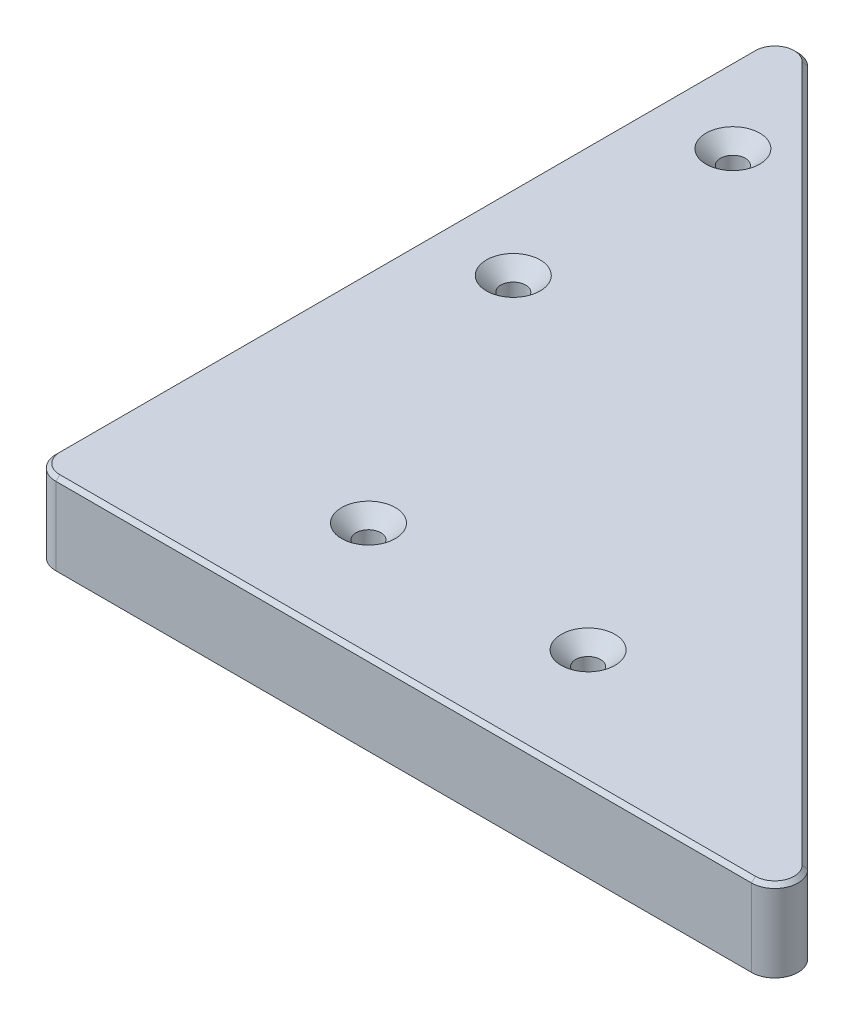
ISO-10303-21;
HEADER;
FILE_DESCRIPTION(('STEP AP214'),'2;1');
FILE_NAME('part.step','',(''),(''),'','','');
FILE_SCHEMA(('AUTOMOTIVE_DESIGN { 1 0 10303 214 1 1 1 1 }'));
ENDSEC;
DATA;
#1=APPLICATION_CONTEXT('core data for automotive mechanical design processes');
#2=APPLICATION_PROTOCOL_DEFINITION('international standard','automotive_design',2000,#1);
#3=PRODUCT_CONTEXT('',#1,'mechanical');
#4=PRODUCT('Part','Part','',(#3));
#5=PRODUCT_RELATED_PRODUCT_CATEGORY('part','',(#4));
#6=PRODUCT_DEFINITION_FORMATION('','',#4);
#7=PRODUCT_DEFINITION_CONTEXT('part definition',#1,'design');
#8=PRODUCT_DEFINITION('design','',#6,#7);
#9=PRODUCT_DEFINITION_SHAPE('','',#8);
#10=(LENGTH_UNIT() NAMED_UNIT(*) SI_UNIT(.MILLI.,.METRE.));
#11=(NAMED_UNIT(*) PLANE_ANGLE_UNIT() SI_UNIT($,.RADIAN.));
#12=(NAMED_UNIT(*) SI_UNIT($,.STERADIAN.) SOLID_ANGLE_UNIT());
#13=UNCERTAINTY_MEASURE_WITH_UNIT(LENGTH_MEASURE(1.E-05),#10,'distance_accuracy_value','');
#14=(GEOMETRIC_REPRESENTATION_CONTEXT(3) GLOBAL_UNCERTAINTY_ASSIGNED_CONTEXT((#13)) GLOBAL_UNIT_ASSIGNED_CONTEXT((#10,
#11,#12)) REPRESENTATION_CONTEXT('',''));
#15=CARTESIAN_POINT('',(0.,0.,0.));
#16=DIRECTION('',(0.,0.,1.));
#17=DIRECTION('',(1.,0.,0.));
#18=AXIS2_PLACEMENT_3D('',#15,#16,#17);
#19=CARTESIAN_POINT('',(0.,0.,0.));
#20=DIRECTION('',(0.,1.,0.));
#21=DIRECTION('',(0.,0.,1.));
#22=AXIS2_PLACEMENT_3D('',#19,#20,#21);
#23=PLANE('',#22);
#24=CARTESIAN_POINT('',(-37.9999999999917,0.,-73.8495209309873));
#25=DIRECTION('',(0.,1.,0.));
#26=DIRECTION('',(0.,0.,1.));
#27=AXIS2_PLACEMENT_3D('',#24,#25,#26);
#28=CIRCLE('',#27,1.59999999999999);
#29=CARTESIAN_POINT('',(-37.9999999999917,0.,-72.2495209309873));
#30=VERTEX_POINT('',#29);
#31=EDGE_CURVE('E230',#30,#30,#28,.T.);
#32=ORIENTED_EDGE('',*,*,#31,.T.);
#33=EDGE_LOOP('',(#32));
#34=FACE_BOUND('',#33,.T.);
#35=CARTESIAN_POINT('',(-37.9999999999917,0.,-45.516187597654));
#36=DIRECTION('',(0.,1.,0.));
#37=DIRECTION('',(0.,0.,1.));
#38=AXIS2_PLACEMENT_3D('',#35,#36,#37);
#39=CIRCLE('',#38,1.59999999999999);
#40=CARTESIAN_POINT('',(-37.9999999999917,0.,-43.916187597654));
#41=VERTEX_POINT('',#40);
#42=EDGE_CURVE('E225',#41,#41,#39,.T.);
#43=ORIENTED_EDGE('',*,*,#42,.T.);
#44=EDGE_LOOP('',(#43));
#45=FACE_BOUND('',#44,.T.);
#46=DIRECTION('',(0.,0.,-1.));
#47=VECTOR('',#46,1.);
#48=CARTESIAN_POINT('',(-47.9999999999917,0.,0.));
#49=LINE('',#48,#47);
#50=CARTESIAN_POINT('',(-47.9999999999917,0.,-21.5000000000502));
#51=VERTEX_POINT('',#50);
#52=CARTESIAN_POINT('',(-47.9999999999917,0.,-86.2573593129309));
#53=VERTEX_POINT('',#52);
#54=EDGE_CURVE('E210',#51,#53,#49,.T.);
#55=ORIENTED_EDGE('',*,*,#54,.T.);
#56=CARTESIAN_POINT('',(-44.9999999999917,0.,-86.2573593129309));
#57=DIRECTION('',(0.,1.,0.));
#58=DIRECTION('',(0.,0.,1.));
#59=AXIS2_PLACEMENT_3D('',#56,#57,#58);
#60=CIRCLE('',#59,3.);
#61=CARTESIAN_POINT('',(-42.8786796564321,0.,-88.3786796564905));
#62=VERTEX_POINT('',#61);
#63=EDGE_CURVE('E257',#53,#62,#60,.F.);
#64=ORIENTED_EDGE('',*,*,#63,.T.);
#65=DIRECTION('',(0.707106781186548,0.,0.707106781186548));
#66=VECTOR('',#65,1.);
#67=CARTESIAN_POINT('',(22.7500000000292,0.,-22.7500000000292));
#68=LINE('',#67,#66);
#69=CARTESIAN_POINT('',(-22.8786796564321,0.,-68.3786796564905));
#70=VERTEX_POINT('',#69);
#71=EDGE_CURVE('E208',#62,#70,#68,.T.);
#72=ORIENTED_EDGE('',*,*,#71,.T.);
#73=CARTESIAN_POINT('',(-24.9999999999917,0.,-66.2573593129309));
#74=DIRECTION('',(0.,1.,0.));
#75=DIRECTION('',(0.,0.,1.));
#76=AXIS2_PLACEMENT_3D('',#73,#74,#75);
#77=CIRCLE('',#76,3.);
#78=CARTESIAN_POINT('',(-27.9999999999917,0.,-66.2573593129309));
#79=VERTEX_POINT('',#78);
#80=EDGE_CURVE('E271',#70,#79,#77,.T.);
#81=ORIENTED_EDGE('',*,*,#80,.T.);
#82=DIRECTION('',(0.,0.,-1.));
#83=VECTOR('',#82,1.);
#84=CARTESIAN_POINT('',(-27.9999999999917,0.,0.));
#85=LINE('',#84,#83);
#86=CARTESIAN_POINT('',(-27.9999999999917,0.,-23.5000000000502));
#87=VERTEX_POINT('',#86);
#88=EDGE_CURVE('E203',#87,#79,#85,.T.);
#89=ORIENTED_EDGE('',*,*,#88,.F.);
#90=DIRECTION('',(-1.,0.,0.));
#91=VECTOR('',#90,1.);
#92=CARTESIAN_POINT('',(0.,0.,-23.5000000000502));
#93=LINE('',#92,#91);
#94=CARTESIAN_POINT('',(-45.9999999999917,0.,-23.5000000000502));
#95=VERTEX_POINT('',#94);
#96=EDGE_CURVE('E173',#87,#95,#93,.T.);
#97=ORIENTED_EDGE('',*,*,#96,.T.);
#98=CARTESIAN_POINT('',(-45.9999999999917,0.,-21.5000000000502));
#99=DIRECTION('',(0.,1.,0.));
#100=DIRECTION('',(0.,0.,1.));
#101=AXIS2_PLACEMENT_3D('',#98,#99,#100);
#102=CIRCLE('',#101,2.);
#103=EDGE_CURVE('E287',#95,#51,#102,.T.);
#104=ORIENTED_EDGE('',*,*,#103,.T.);
#105=EDGE_LOOP('',(#55,#64,#72,#81,#89,#97,#104));
#106=FACE_BOUND('',#105,.T.);
#107=ADVANCED_FACE('F38',(#34,#45,#106),#23,.F.);
#108=CARTESIAN_POINT('',(22.7500000000292,10.5,-22.7500000000292));
#109=DIRECTION('',(0.707106781186547,0.,-0.707106781186547));
#110=DIRECTION('',(-0.707106781186548,0.,-0.707106781186548));
#111=AXIS2_PLACEMENT_3D('',#108,#109,#110);
#112=PLANE('',#111);
#113=DIRECTION('',(0.,-1.,0.));
#114=VECTOR('',#113,1.);
#115=CARTESIAN_POINT('',(-42.878679656432,10.5,-88.3786796564905));
#116=LINE('',#115,#114);
#117=CARTESIAN_POINT('',(-42.878679656432,10.,-88.3786796564905));
#118=VERTEX_POINT('',#117);
#119=EDGE_CURVE('E239',#62,#118,#116,.F.);
#120=ORIENTED_EDGE('',*,*,#119,.T.);
#121=DIRECTION('',(0.707106781186548,0.,0.707106781186548));
#122=VECTOR('',#121,1.);
#123=CARTESIAN_POINT('',(22.7500000000292,10.,-22.7500000000292));
#124=LINE('',#123,#122);
#125=CARTESIAN_POINT('',(46.8786796564487,10.,1.3786796563902));
#126=VERTEX_POINT('',#125);
#127=EDGE_CURVE('E308',#118,#126,#124,.T.);
#128=ORIENTED_EDGE('',*,*,#127,.T.);
#129=DIRECTION('',(0.,-1.,0.));
#130=VECTOR('',#129,1.);
#131=CARTESIAN_POINT('',(46.8786796564487,0.,1.3786796563902));
#132=LINE('',#131,#130);
#133=CARTESIAN_POINT('',(46.8786796564487,0.,1.3786796563902));
#134=VERTEX_POINT('',#133);
#135=EDGE_CURVE('E237',#126,#134,#132,.T.);
#136=ORIENTED_EDGE('',*,*,#135,.T.);
#137=CARTESIAN_POINT('',(21.8786796564487,0.,-23.6213203436098));
#138=VERTEX_POINT('',#137);
#139=EDGE_CURVE('E177',#138,#134,#68,.T.);
#140=ORIENTED_EDGE('',*,*,#139,.F.);
#141=DIRECTION('',(0.,1.,0.));
#142=VECTOR('',#141,1.);
#143=CARTESIAN_POINT('',(21.8786796564487,10.5,-23.6213203436098));
#144=LINE('',#143,#142);
#145=CARTESIAN_POINT('',(21.8786796564487,-20.,-23.6213203436098));
#146=VERTEX_POINT('',#145);
#147=EDGE_CURVE('E245',#138,#146,#144,.F.);
#148=ORIENTED_EDGE('',*,*,#147,.T.);
#149=DIRECTION('',(0.707106781186548,0.,0.707106781186548));
#150=VECTOR('',#149,1.);
#151=CARTESIAN_POINT('',(22.7500000000292,-20.,-22.7500000000292));
#152=LINE('',#151,#150);
#153=CARTESIAN_POINT('',(-22.8786796564321,-20.,-68.3786796564905));
#154=VERTEX_POINT('',#153);
#155=EDGE_CURVE('E178',#154,#146,#152,.T.);
#156=ORIENTED_EDGE('',*,*,#155,.F.);
#157=DIRECTION('',(0.,1.,0.));
#158=VECTOR('',#157,1.);
#159=CARTESIAN_POINT('',(-22.878679656432,0.,-68.3786796564905));
#160=LINE('',#159,#158);
#161=EDGE_CURVE('E242',#154,#70,#160,.T.);
#162=ORIENTED_EDGE('',*,*,#161,.T.);
#163=ORIENTED_EDGE('',*,*,#71,.F.);
#164=EDGE_LOOP('',(#120,#128,#136,#140,#148,#156,#162,#163));
#165=FACE_BOUND('',#164,.T.);
#166=ADVANCED_FACE('F379',(#165),#112,.T.);
#167=CARTESIAN_POINT('',(-47.9999999999917,10.5,0.));
#168=DIRECTION('',(-1.,0.,0.));
#169=DIRECTION('',(0.,0.,1.));
#170=AXIS2_PLACEMENT_3D('',#167,#168,#169);
#171=PLANE('',#170);
#172=DIRECTION('',(0.,-1.,0.));
#173=VECTOR('',#172,1.);
#174=CARTESIAN_POINT('',(-47.9999999999917,10.5,3.49999999994984));
#175=LINE('',#174,#173);
#176=CARTESIAN_POINT('',(-47.9999999999917,0.,3.49999999994984));
#177=VERTEX_POINT('',#176);
#178=CARTESIAN_POINT('',(-47.9999999999917,10.,3.49999999994984));
#179=VERTEX_POINT('',#178);
#180=EDGE_CURVE('E253',#177,#179,#175,.F.);
#181=ORIENTED_EDGE('',*,*,#180,.T.);
#182=DIRECTION('',(0.,0.,-1.));
#183=VECTOR('',#182,1.);
#184=CARTESIAN_POINT('',(-47.9999999999917,10.,0.));
#185=LINE('',#184,#183);
#186=CARTESIAN_POINT('',(-47.9999999999917,10.,-86.2573593129309));
#187=VERTEX_POINT('',#186);
#188=EDGE_CURVE('E11',#179,#187,#185,.T.);
#189=ORIENTED_EDGE('',*,*,#188,.T.);
#190=DIRECTION('',(0.,-1.,0.));
#191=VECTOR('',#190,1.);
#192=CARTESIAN_POINT('',(-47.9999999999917,10.5,-86.2573593129309));
#193=LINE('',#192,#191);
#194=EDGE_CURVE('E255',#187,#53,#193,.T.);
#195=ORIENTED_EDGE('',*,*,#194,.T.);
#196=ORIENTED_EDGE('',*,*,#54,.F.);
#197=DIRECTION('',(0.,1.,0.));
#198=VECTOR('',#197,1.);
#199=CARTESIAN_POINT('',(-47.9999999999917,10.5,-21.5000000000502));
#200=LINE('',#199,#198);
#201=CARTESIAN_POINT('',(-47.9999999999917,-20.,-21.5000000000502));
#202=VERTEX_POINT('',#201);
#203=EDGE_CURVE('E273',#51,#202,#200,.F.);
#204=ORIENTED_EDGE('',*,*,#203,.T.);
#205=DIRECTION('',(0.,0.,-1.));
#206=VECTOR('',#205,1.);
#207=CARTESIAN_POINT('',(-47.9999999999917,-20.,0.));
#208=LINE('',#207,#206);
#209=CARTESIAN_POINT('',(-47.9999999999917,-20.,-20.5000000000502));
#210=VERTEX_POINT('',#209);
#211=EDGE_CURVE('E194',#210,#202,#208,.T.);
#212=ORIENTED_EDGE('',*,*,#211,.F.);
#213=DIRECTION('',(0.,1.,0.));
#214=VECTOR('',#213,1.);
#215=CARTESIAN_POINT('',(-47.9999999999917,10.5,-20.5000000000502));
#216=LINE('',#215,#214);
#217=CARTESIAN_POINT('',(-47.9999999999917,0.,-20.5000000000502));
#218=VERTEX_POINT('',#217);
#219=EDGE_CURVE('E275',#210,#218,#216,.T.);
#220=ORIENTED_EDGE('',*,*,#219,.T.);
#221=EDGE_CURVE('E211',#177,#218,#49,.T.);
#222=ORIENTED_EDGE('',*,*,#221,.F.);
#223=EDGE_LOOP('',(#181,#189,#195,#196,#204,#212,#220,#222));
#224=FACE_BOUND('',#223,.T.);
#225=ADVANCED_FACE('F373',(#224),#171,.T.);
#226=CARTESIAN_POINT('',(0.,10.5,6.49999999994984));
#227=DIRECTION('',(0.,0.,-1.));
#228=DIRECTION('',(-1.,0.,0.));
#229=AXIS2_PLACEMENT_3D('',#226,#227,#228);
#230=PLANE('',#229);
#231=DIRECTION('',(0.,-1.,0.));
#232=VECTOR('',#231,1.);
#233=CARTESIAN_POINT('',(44.757359312889,10.5,6.49999999994984));
#234=LINE('',#233,#232);
#235=CARTESIAN_POINT('',(44.757359312889,0.,6.49999999994984));
#236=VERTEX_POINT('',#235);
#237=CARTESIAN_POINT('',(44.757359312889,10.,6.49999999994984));
#238=VERTEX_POINT('',#237);
#239=EDGE_CURVE('E265',#236,#238,#234,.F.);
#240=ORIENTED_EDGE('',*,*,#239,.T.);
#241=DIRECTION('',(-1.,0.,0.));
#242=VECTOR('',#241,1.);
#243=CARTESIAN_POINT('',(-44.9999999999917,10.,6.49999999994984));
#244=LINE('',#243,#242);
#245=CARTESIAN_POINT('',(-44.9999999999917,10.,6.49999999994984));
#246=VERTEX_POINT('',#245);
#247=EDGE_CURVE('E306',#238,#246,#244,.T.);
#248=ORIENTED_EDGE('',*,*,#247,.T.);
#249=DIRECTION('',(0.,-1.,0.));
#250=VECTOR('',#249,1.);
#251=CARTESIAN_POINT('',(-44.9999999999917,0.,6.49999999994984));
#252=LINE('',#251,#250);
#253=CARTESIAN_POINT('',(-44.9999999999917,0.,6.49999999994984));
#254=VERTEX_POINT('',#253);
#255=EDGE_CURVE('E263',#246,#254,#252,.T.);
#256=ORIENTED_EDGE('',*,*,#255,.T.);
#257=DIRECTION('',(1.,0.,0.));
#258=VECTOR('',#257,1.);
#259=CARTESIAN_POINT('',(0.,0.,6.49999999994984));
#260=LINE('',#259,#258);
#261=EDGE_CURVE('E213',#254,#236,#260,.T.);
#262=ORIENTED_EDGE('',*,*,#261,.T.);
#263=EDGE_LOOP('',(#240,#248,#256,#262));
#264=FACE_BOUND('',#263,.T.);
#265=ADVANCED_FACE('F364',(#264),#230,.F.);
#266=CARTESIAN_POINT('',(0.,10.5,0.));
#267=DIRECTION('',(0.,1.,0.));
#268=DIRECTION('',(0.,0.,1.));
#269=AXIS2_PLACEMENT_3D('',#266,#267,#268);
#270=PLANE('',#269);
#271=DIRECTION('',(1.,0.,0.));
#272=VECTOR('',#271,1.);
#273=CARTESIAN_POINT('',(44.757359312889,10.5,5.99999999994984));
#274=LINE('',#273,#272);
#275=CARTESIAN_POINT('',(-44.9999999999917,10.5,5.99999999994984));
#276=VERTEX_POINT('',#275);
#277=CARTESIAN_POINT('',(44.757359312889,10.5,5.99999999994984));
#278=VERTEX_POINT('',#277);
#279=EDGE_CURVE('E298',#276,#278,#274,.T.);
#280=ORIENTED_EDGE('',*,*,#279,.T.);
#281=CARTESIAN_POINT('',(44.757359312889,10.5,3.49999999994984));
#282=DIRECTION('',(0.,1.,0.));
#283=DIRECTION('',(0.,0.,1.));
#284=AXIS2_PLACEMENT_3D('',#281,#282,#283);
#285=CIRCLE('',#284,2.5);
#286=CARTESIAN_POINT('',(46.5251262658554,10.5,1.73223304698348));
#287=VERTEX_POINT('',#286);
#288=EDGE_CURVE('E300',#278,#287,#285,.T.);
#289=ORIENTED_EDGE('',*,*,#288,.T.);
#290=DIRECTION('',(-0.707106781186548,0.,-0.707106781186548));
#291=VECTOR('',#290,1.);
#292=CARTESIAN_POINT('',(22.396446609436,10.5,-22.396446609436));
#293=LINE('',#292,#291);
#294=CARTESIAN_POINT('',(-43.2322330470253,10.5,-88.0251262658972));
#295=VERTEX_POINT('',#294);
#296=EDGE_CURVE('E296',#287,#295,#293,.T.);
#297=ORIENTED_EDGE('',*,*,#296,.T.);
#298=CARTESIAN_POINT('',(-44.9999999999917,10.5,-86.2573593129309));
#299=DIRECTION('',(0.,1.,0.));
#300=DIRECTION('',(0.,0.,1.));
#301=AXIS2_PLACEMENT_3D('',#298,#299,#300);
#302=CIRCLE('',#301,2.5);
#303=CARTESIAN_POINT('',(-47.4999999999917,10.5,-86.2573593129309));
#304=VERTEX_POINT('',#303);
#305=EDGE_CURVE('E292',#295,#304,#302,.T.);
#306=ORIENTED_EDGE('',*,*,#305,.T.);
#307=DIRECTION('',(0.,0.,1.));
#308=VECTOR('',#307,1.);
#309=CARTESIAN_POINT('',(-47.4999999999917,10.5,0.));
#310=LINE('',#309,#308);
#311=CARTESIAN_POINT('',(-47.4999999999917,10.5,3.49999999994984));
#312=VERTEX_POINT('',#311);
#313=EDGE_CURVE('E290',#304,#312,#310,.T.);
#314=ORIENTED_EDGE('',*,*,#313,.T.);
#315=CARTESIAN_POINT('',(-44.9999999999917,10.5,3.49999999994984));
#316=DIRECTION('',(0.,1.,0.));
#317=DIRECTION('',(0.,0.,1.));
#318=AXIS2_PLACEMENT_3D('',#315,#316,#317);
#319=CIRCLE('',#318,2.5);
#320=EDGE_CURVE('E294',#312,#276,#319,.T.);
#321=ORIENTED_EDGE('',*,*,#320,.T.);
#322=EDGE_LOOP('',(#280,#289,#297,#306,#314,#321));
#323=FACE_BOUND('',#322,.T.);
#324=CARTESIAN_POINT('',(-37.9999999999917,10.5,-73.8495209309873));
#325=DIRECTION('',(0.,1.,0.));
#326=DIRECTION('',(0.,0.,1.));
#327=AXIS2_PLACEMENT_3D('',#324,#325,#326);
#328=CIRCLE('',#327,3.47);
#329=CARTESIAN_POINT('',(-37.9999999999917,10.5,-70.3795209309873));
#330=VERTEX_POINT('',#329);
#331=EDGE_CURVE('E328',#330,#330,#328,.T.);
#332=ORIENTED_EDGE('',*,*,#331,.F.);
#333=EDGE_LOOP('',(#332));
#334=FACE_BOUND('',#333,.T.);
#335=CARTESIAN_POINT('',(-37.9999999999917,10.5,-45.516187597654));
#336=DIRECTION('',(0.,1.,0.));
#337=DIRECTION('',(0.,0.,1.));
#338=AXIS2_PLACEMENT_3D('',#335,#336,#337);
#339=CIRCLE('',#338,3.47);
#340=CARTESIAN_POINT('',(-37.9999999999917,10.5,-42.046187597654));
#341=VERTEX_POINT('',#340);
#342=EDGE_CURVE('E233',#341,#341,#339,.T.);
#343=ORIENTED_EDGE('',*,*,#342,.F.);
#344=EDGE_LOOP('',(#343));
#345=FACE_BOUND('',#344,.T.);
#346=CARTESIAN_POINT('',(8.666666666675,10.5,-8.50000000005016));
#347=DIRECTION('',(0.,1.,0.));
#348=DIRECTION('',(0.,0.,1.));
#349=AXIS2_PLACEMENT_3D('',#346,#347,#348);
#350=CIRCLE('',#349,3.47);
#351=CARTESIAN_POINT('',(8.666666666675,10.5,-5.03000000005016));
#352=VERTEX_POINT('',#351);
#353=EDGE_CURVE('E228',#352,#352,#350,.T.);
#354=ORIENTED_EDGE('',*,*,#353,.F.);
#355=EDGE_LOOP('',(#354));
#356=FACE_BOUND('',#355,.T.);
#357=CARTESIAN_POINT('',(-19.6666666666583,10.5,-8.50000000005016));
#358=DIRECTION('',(0.,1.,0.));
#359=DIRECTION('',(0.,0.,1.));
#360=AXIS2_PLACEMENT_3D('',#357,#358,#359);
#361=CIRCLE('',#360,3.47);
#362=CARTESIAN_POINT('',(-19.6666666666583,10.5,-5.03000000005016));
#363=VERTEX_POINT('',#362);
#364=EDGE_CURVE('E223',#363,#363,#361,.T.);
#365=ORIENTED_EDGE('',*,*,#364,.F.);
#366=EDGE_LOOP('',(#365));
#367=FACE_BOUND('',#366,.T.);
#368=ADVANCED_FACE('F361',(#323,#334,#345,#356,#367),#270,.T.);
#369=CARTESIAN_POINT('',(8.666666666675,0.,-8.50000000005016));
#370=DIRECTION('',(0.,1.,0.));
#371=DIRECTION('',(0.,0.,1.));
#372=AXIS2_PLACEMENT_3D('',#369,#370,#371);
#373=CIRCLE('',#372,1.6);
#374=CARTESIAN_POINT('',(8.666666666675,0.,-6.90000000005017));
#375=VERTEX_POINT('',#374);
#376=EDGE_CURVE('E220',#375,#375,#373,.T.);
#377=ORIENTED_EDGE('',*,*,#376,.T.);
#378=EDGE_LOOP('',(#377));
#379=FACE_BOUND('',#378,.T.);
#380=CARTESIAN_POINT('',(-19.6666666666583,0.,-8.50000000005016));
#381=DIRECTION('',(0.,1.,0.));
#382=DIRECTION('',(0.,0.,1.));
#383=AXIS2_PLACEMENT_3D('',#380,#381,#382);
#384=CIRCLE('',#383,1.6);
#385=CARTESIAN_POINT('',(-19.6666666666583,0.,-6.90000000005016));
#386=VERTEX_POINT('',#385);
#387=EDGE_CURVE('E205',#386,#386,#384,.T.);
#388=ORIENTED_EDGE('',*,*,#387,.T.);
#389=EDGE_LOOP('',(#388));
#390=FACE_BOUND('',#389,.T.);
#391=ORIENTED_EDGE('',*,*,#139,.T.);
#392=CARTESIAN_POINT('',(44.757359312889,0.,3.49999999994984));
#393=DIRECTION('',(0.,1.,0.));
#394=DIRECTION('',(0.,0.,1.));
#395=AXIS2_PLACEMENT_3D('',#392,#393,#394);
#396=CIRCLE('',#395,3.);
#397=EDGE_CURVE('E261',#134,#236,#396,.F.);
#398=ORIENTED_EDGE('',*,*,#397,.T.);
#399=ORIENTED_EDGE('',*,*,#261,.F.);
#400=CARTESIAN_POINT('',(-44.9999999999917,0.,3.49999999994984));
#401=DIRECTION('',(0.,1.,0.));
#402=DIRECTION('',(0.,0.,1.));
#403=AXIS2_PLACEMENT_3D('',#400,#401,#402);
#404=CIRCLE('',#403,3.);
#405=EDGE_CURVE('E259',#254,#177,#404,.F.);
#406=ORIENTED_EDGE('',*,*,#405,.T.);
#407=ORIENTED_EDGE('',*,*,#221,.T.);
#408=CARTESIAN_POINT('',(-45.9999999999917,0.,-20.5000000000502));
#409=DIRECTION('',(0.,1.,0.));
#410=DIRECTION('',(0.,0.,1.));
#411=AXIS2_PLACEMENT_3D('',#408,#409,#410);
#412=CIRCLE('',#411,2.);
#413=CARTESIAN_POINT('',(-45.9999999999917,0.,-18.5000000000502));
#414=VERTEX_POINT('',#413);
#415=EDGE_CURVE('E285',#218,#414,#412,.T.);
#416=ORIENTED_EDGE('',*,*,#415,.T.);
#417=DIRECTION('',(1.,0.,0.));
#418=VECTOR('',#417,1.);
#419=CARTESIAN_POINT('',(0.,0.,-18.5000000000502));
#420=LINE('',#419,#418);
#421=CARTESIAN_POINT('',(19.757359312889,0.,-18.5000000000502));
#422=VERTEX_POINT('',#421);
#423=EDGE_CURVE('E187',#414,#422,#420,.T.);
#424=ORIENTED_EDGE('',*,*,#423,.T.);
#425=CARTESIAN_POINT('',(19.757359312889,0.,-21.5000000000502));
#426=DIRECTION('',(0.,1.,0.));
#427=DIRECTION('',(0.,0.,1.));
#428=AXIS2_PLACEMENT_3D('',#425,#426,#427);
#429=CIRCLE('',#428,3.);
#430=EDGE_CURVE('E268',#422,#138,#429,.T.);
#431=ORIENTED_EDGE('',*,*,#430,.T.);
#432=EDGE_LOOP('',(#391,#398,#399,#406,#407,#416,#424,#431));
#433=FACE_BOUND('',#432,.T.);
#434=ADVANCED_FACE('F363',(#379,#390,#433),#23,.F.);
#435=CARTESIAN_POINT('',(-27.9999999999917,-20.,0.));
#436=DIRECTION('',(1.,0.,0.));
#437=DIRECTION('',(0.,0.,-1.));
#438=AXIS2_PLACEMENT_3D('',#435,#436,#437);
#439=PLANE('',#438);
#440=ORIENTED_EDGE('',*,*,#88,.T.);
#441=DIRECTION('',(0.,1.,0.));
#442=VECTOR('',#441,1.);
#443=CARTESIAN_POINT('',(-27.9999999999917,-20.,-66.2573593129309));
#444=LINE('',#443,#442);
#445=CARTESIAN_POINT('',(-27.9999999999917,-20.,-66.2573593129309));
#446=VERTEX_POINT('',#445);
#447=EDGE_CURVE('E184',#79,#446,#444,.F.);
#448=ORIENTED_EDGE('',*,*,#447,.T.);
#449=DIRECTION('',(0.,0.,-1.));
#450=VECTOR('',#449,1.);
#451=CARTESIAN_POINT('',(-27.9999999999917,-20.,0.));
#452=LINE('',#451,#450);
#453=CARTESIAN_POINT('',(-27.9999999999917,-20.,-23.5000000000502));
#454=VERTEX_POINT('',#453);
#455=EDGE_CURVE('E181',#454,#446,#452,.T.);
#456=ORIENTED_EDGE('',*,*,#455,.F.);
#457=DIRECTION('',(0.,1.,0.));
#458=VECTOR('',#457,1.);
#459=CARTESIAN_POINT('',(-27.9999999999917,-20.,-23.5000000000502));
#460=LINE('',#459,#458);
#461=EDGE_CURVE('E165',#454,#87,#460,.T.);
#462=ORIENTED_EDGE('',*,*,#461,.T.);
#463=EDGE_LOOP('',(#440,#448,#456,#462));
#464=FACE_BOUND('',#463,.T.);
#465=ADVANCED_FACE('F182',(#464),#439,.F.);
#466=CARTESIAN_POINT('',(0.,-20.,-18.5000000000502));
#467=DIRECTION('',(0.,0.,1.));
#468=DIRECTION('',(1.,0.,0.));
#469=AXIS2_PLACEMENT_3D('',#466,#467,#468);
#470=PLANE('',#469);
#471=ORIENTED_EDGE('',*,*,#423,.F.);
#472=DIRECTION('',(0.,1.,0.));
#473=VECTOR('',#472,1.);
#474=CARTESIAN_POINT('',(-45.9999999999917,-20.,-18.5000000000502));
#475=LINE('',#474,#473);
#476=CARTESIAN_POINT('',(-45.9999999999917,-20.,-18.5000000000502));
#477=VERTEX_POINT('',#476);
#478=EDGE_CURVE('E278',#414,#477,#475,.F.);
#479=ORIENTED_EDGE('',*,*,#478,.T.);
#480=DIRECTION('',(1.,0.,0.));
#481=VECTOR('',#480,1.);
#482=CARTESIAN_POINT('',(0.,-20.,-18.5000000000502));
#483=LINE('',#482,#481);
#484=CARTESIAN_POINT('',(19.757359312889,-20.,-18.5000000000502));
#485=VERTEX_POINT('',#484);
#486=EDGE_CURVE('E196',#477,#485,#483,.T.);
#487=ORIENTED_EDGE('',*,*,#486,.T.);
#488=DIRECTION('',(0.,1.,0.));
#489=VECTOR('',#488,1.);
#490=CARTESIAN_POINT('',(19.757359312889,-20.,-18.5000000000502));
#491=LINE('',#490,#489);
#492=EDGE_CURVE('E216',#485,#422,#491,.T.);
#493=ORIENTED_EDGE('',*,*,#492,.T.);
#494=EDGE_LOOP('',(#471,#479,#487,#493));
#495=FACE_BOUND('',#494,.T.);
#496=ADVANCED_FACE('F479',(#495),#470,.T.);
#497=CARTESIAN_POINT('',(0.,-20.,-23.5000000000502));
#498=DIRECTION('',(0.,0.,-1.));
#499=DIRECTION('',(-1.,0.,0.));
#500=AXIS2_PLACEMENT_3D('',#497,#498,#499);
#501=PLANE('',#500);
#502=DIRECTION('',(-1.,0.,0.));
#503=VECTOR('',#502,1.);
#504=CARTESIAN_POINT('',(0.,-20.,-23.5000000000502));
#505=LINE('',#504,#503);
#506=CARTESIAN_POINT('',(-45.9999999999917,-20.,-23.5000000000502));
#507=VERTEX_POINT('',#506);
#508=EDGE_CURVE('E170',#454,#507,#505,.T.);
#509=ORIENTED_EDGE('',*,*,#508,.T.);
#510=DIRECTION('',(0.,1.,0.));
#511=VECTOR('',#510,1.);
#512=CARTESIAN_POINT('',(-45.9999999999917,-20.,-23.5000000000502));
#513=LINE('',#512,#511);
#514=EDGE_CURVE('E283',#507,#95,#513,.T.);
#515=ORIENTED_EDGE('',*,*,#514,.T.);
#516=ORIENTED_EDGE('',*,*,#96,.F.);
#517=ORIENTED_EDGE('',*,*,#461,.F.);
#518=EDGE_LOOP('',(#509,#515,#516,#517));
#519=FACE_BOUND('',#518,.T.);
#520=ADVANCED_FACE('F167',(#519),#501,.T.);
#521=CARTESIAN_POINT('',(0.,-20.,0.));
#522=DIRECTION('',(0.,1.,0.));
#523=DIRECTION('',(0.,0.,1.));
#524=AXIS2_PLACEMENT_3D('',#521,#522,#523);
#525=PLANE('',#524);
#526=ORIENTED_EDGE('',*,*,#486,.F.);
#527=CARTESIAN_POINT('',(-45.9999999999917,-20.,-20.5000000000502));
#528=DIRECTION('',(0.,1.,0.));
#529=DIRECTION('',(0.,0.,1.));
#530=AXIS2_PLACEMENT_3D('',#527,#528,#529);
#531=CIRCLE('',#530,2.);
#532=EDGE_CURVE('E281',#477,#210,#531,.F.);
#533=ORIENTED_EDGE('',*,*,#532,.T.);
#534=ORIENTED_EDGE('',*,*,#211,.T.);
#535=CARTESIAN_POINT('',(-45.9999999999917,-20.,-21.5000000000502));
#536=DIRECTION('',(0.,1.,0.));
#537=DIRECTION('',(0.,0.,1.));
#538=AXIS2_PLACEMENT_3D('',#535,#536,#537);
#539=CIRCLE('',#538,2.);
#540=EDGE_CURVE('E193',#202,#507,#539,.F.);
#541=ORIENTED_EDGE('',*,*,#540,.T.);
#542=ORIENTED_EDGE('',*,*,#508,.F.);
#543=ORIENTED_EDGE('',*,*,#455,.T.);
#544=CARTESIAN_POINT('',(-24.9999999999917,-20.,-66.2573593129309));
#545=DIRECTION('',(0.,1.,0.));
#546=DIRECTION('',(0.,0.,1.));
#547=AXIS2_PLACEMENT_3D('',#544,#545,#546);
#548=CIRCLE('',#547,3.);
#549=EDGE_CURVE('E247',#446,#154,#548,.F.);
#550=ORIENTED_EDGE('',*,*,#549,.T.);
#551=ORIENTED_EDGE('',*,*,#155,.T.);
#552=CARTESIAN_POINT('',(19.757359312889,-20.,-21.5000000000502));
#553=DIRECTION('',(0.,1.,0.));
#554=DIRECTION('',(0.,0.,1.));
#555=AXIS2_PLACEMENT_3D('',#552,#553,#554);
#556=CIRCLE('',#555,3.);
#557=EDGE_CURVE('E249',#146,#485,#556,.F.);
#558=ORIENTED_EDGE('',*,*,#557,.T.);
#559=EDGE_LOOP('',(#526,#533,#534,#541,#542,#543,#550,#551,#558));
#560=FACE_BOUND('',#559,.T.);
#561=ADVANCED_FACE('F190',(#560),#525,.F.);
#562=CARTESIAN_POINT('',(-19.6666666666583,10.5,-8.50000000005016));
#563=DIRECTION('',(0.,1.,0.));
#564=DIRECTION('',(0.,0.,1.));
#565=AXIS2_PLACEMENT_3D('',#562,#563,#564);
#566=CYLINDRICAL_SURFACE('',#565,1.6);
#567=CARTESIAN_POINT('',(-19.6666666666583,8.63,-8.50000000005016));
#568=DIRECTION('',(0.,1.,0.));
#569=DIRECTION('',(0.,0.,1.));
#570=AXIS2_PLACEMENT_3D('',#567,#568,#569);
#571=CIRCLE('',#570,1.6);
#572=CARTESIAN_POINT('',(-19.6666666666583,8.63,-6.90000000005016));
#573=VERTEX_POINT('',#572);
#574=EDGE_CURVE('E219',#573,#573,#571,.T.);
#575=ORIENTED_EDGE('',*,*,#574,.T.);
#576=EDGE_LOOP('',(#575));
#577=FACE_BOUND('',#576,.T.);
#578=ORIENTED_EDGE('',*,*,#387,.F.);
#579=EDGE_LOOP('',(#578));
#580=FACE_BOUND('',#579,.T.);
#581=ADVANCED_FACE('F351',(#577,#580),#566,.F.);
#582=CARTESIAN_POINT('',(-19.6666666666583,10.5,-8.50000000005016));
#583=DIRECTION('',(0.,1.,0.));
#584=DIRECTION('',(0.,0.,1.));
#585=AXIS2_PLACEMENT_3D('',#582,#583,#584);
#586=CONICAL_SURFACE('',#585,3.47,0.785398163397448);
#587=ORIENTED_EDGE('',*,*,#574,.F.);
#588=EDGE_LOOP('',(#587));
#589=FACE_BOUND('',#588,.T.);
#590=ORIENTED_EDGE('',*,*,#364,.T.);
#591=EDGE_LOOP('',(#590));
#592=FACE_BOUND('',#591,.T.);
#593=ADVANCED_FACE('F354',(#589,#592),#586,.F.);
#594=CARTESIAN_POINT('',(8.666666666675,10.5,-8.50000000005016));
#595=DIRECTION('',(0.,1.,0.));
#596=DIRECTION('',(0.,0.,1.));
#597=AXIS2_PLACEMENT_3D('',#594,#595,#596);
#598=CYLINDRICAL_SURFACE('',#597,1.6);
#599=CARTESIAN_POINT('',(8.666666666675,8.63,-8.50000000005016));
#600=DIRECTION('',(0.,1.,0.));
#601=DIRECTION('',(0.,0.,1.));
#602=AXIS2_PLACEMENT_3D('',#599,#600,#601);
#603=CIRCLE('',#602,1.6);
#604=CARTESIAN_POINT('',(8.666666666675,8.63,-6.90000000005016));
#605=VERTEX_POINT('',#604);
#606=EDGE_CURVE('E224',#605,#605,#603,.T.);
#607=ORIENTED_EDGE('',*,*,#606,.T.);
#608=EDGE_LOOP('',(#607));
#609=FACE_BOUND('',#608,.T.);
#610=ORIENTED_EDGE('',*,*,#376,.F.);
#611=EDGE_LOOP('',(#610));
#612=FACE_BOUND('',#611,.T.);
#613=ADVANCED_FACE('F357',(#609,#612),#598,.F.);
#614=CARTESIAN_POINT('',(8.666666666675,10.5,-8.50000000005016));
#615=DIRECTION('',(0.,1.,0.));
#616=DIRECTION('',(0.,0.,1.));
#617=AXIS2_PLACEMENT_3D('',#614,#615,#616);
#618=CONICAL_SURFACE('',#617,3.47,0.785398163397448);
#619=ORIENTED_EDGE('',*,*,#606,.F.);
#620=EDGE_LOOP('',(#619));
#621=FACE_BOUND('',#620,.T.);
#622=ORIENTED_EDGE('',*,*,#353,.T.);
#623=EDGE_LOOP('',(#622));
#624=FACE_BOUND('',#623,.T.);
#625=ADVANCED_FACE('F494',(#621,#624),#618,.F.);
#626=CARTESIAN_POINT('',(-37.9999999999917,10.5,-45.516187597654));
#627=DIRECTION('',(0.,1.,0.));
#628=DIRECTION('',(0.,0.,1.));
#629=AXIS2_PLACEMENT_3D('',#626,#627,#628);
#630=CYLINDRICAL_SURFACE('',#629,1.59999999999999);
#631=CARTESIAN_POINT('',(-37.9999999999917,8.63,-45.516187597654));
#632=DIRECTION('',(0.,1.,0.));
#633=DIRECTION('',(0.,0.,1.));
#634=AXIS2_PLACEMENT_3D('',#631,#632,#633);
#635=CIRCLE('',#634,1.6);
#636=CARTESIAN_POINT('',(-37.9999999999917,8.63,-43.916187597654));
#637=VERTEX_POINT('',#636);
#638=EDGE_CURVE('E229',#637,#637,#635,.T.);
#639=ORIENTED_EDGE('',*,*,#638,.T.);
#640=EDGE_LOOP('',(#639));
#641=FACE_BOUND('',#640,.T.);
#642=ORIENTED_EDGE('',*,*,#42,.F.);
#643=EDGE_LOOP('',(#642));
#644=FACE_BOUND('',#643,.T.);
#645=ADVANCED_FACE('F498',(#641,#644),#630,.F.);
#646=CARTESIAN_POINT('',(-37.9999999999917,10.5,-45.516187597654));
#647=DIRECTION('',(0.,1.,0.));
#648=DIRECTION('',(0.,0.,1.));
#649=AXIS2_PLACEMENT_3D('',#646,#647,#648);
#650=CONICAL_SURFACE('',#649,3.47,0.785398163397448);
#651=ORIENTED_EDGE('',*,*,#638,.F.);
#652=EDGE_LOOP('',(#651));
#653=FACE_BOUND('',#652,.T.);
#654=ORIENTED_EDGE('',*,*,#342,.T.);
#655=EDGE_LOOP('',(#654));
#656=FACE_BOUND('',#655,.T.);
#657=ADVANCED_FACE('F502',(#653,#656),#650,.F.);
#658=CARTESIAN_POINT('',(-37.9999999999917,10.5,-73.8495209309873));
#659=DIRECTION('',(0.,1.,0.));
#660=DIRECTION('',(0.,0.,1.));
#661=AXIS2_PLACEMENT_3D('',#658,#659,#660);
#662=CYLINDRICAL_SURFACE('',#661,1.59999999999999);
#663=CARTESIAN_POINT('',(-37.9999999999917,8.63,-73.8495209309873));
#664=DIRECTION('',(0.,1.,0.));
#665=DIRECTION('',(0.,0.,1.));
#666=AXIS2_PLACEMENT_3D('',#663,#664,#665);
#667=CIRCLE('',#666,1.6);
#668=CARTESIAN_POINT('',(-37.9999999999917,8.63,-72.2495209309873));
#669=VERTEX_POINT('',#668);
#670=EDGE_CURVE('E234',#669,#669,#667,.T.);
#671=ORIENTED_EDGE('',*,*,#670,.T.);
#672=EDGE_LOOP('',(#671));
#673=FACE_BOUND('',#672,.T.);
#674=ORIENTED_EDGE('',*,*,#31,.F.);
#675=EDGE_LOOP('',(#674));
#676=FACE_BOUND('',#675,.T.);
#677=ADVANCED_FACE('F506',(#673,#676),#662,.F.);
#678=CARTESIAN_POINT('',(-37.9999999999917,10.5,-73.8495209309873));
#679=DIRECTION('',(0.,1.,0.));
#680=DIRECTION('',(0.,0.,1.));
#681=AXIS2_PLACEMENT_3D('',#678,#679,#680);
#682=CONICAL_SURFACE('',#681,3.47,0.785398163397448);
#683=ORIENTED_EDGE('',*,*,#670,.F.);
#684=EDGE_LOOP('',(#683));
#685=FACE_BOUND('',#684,.T.);
#686=ORIENTED_EDGE('',*,*,#331,.T.);
#687=EDGE_LOOP('',(#686));
#688=FACE_BOUND('',#687,.T.);
#689=ADVANCED_FACE('F394',(#685,#688),#682,.F.);
#690=CARTESIAN_POINT('',(19.757359312889,-20.,-21.5000000000502));
#691=DIRECTION('',(0.,1.,0.));
#692=DIRECTION('',(0.,0.,1.));
#693=AXIS2_PLACEMENT_3D('',#690,#691,#692);
#694=CYLINDRICAL_SURFACE('',#693,3.);
#695=ORIENTED_EDGE('',*,*,#557,.F.);
#696=ORIENTED_EDGE('',*,*,#147,.F.);
#697=ORIENTED_EDGE('',*,*,#430,.F.);
#698=ORIENTED_EDGE('',*,*,#492,.F.);
#699=EDGE_LOOP('',(#695,#696,#697,#698));
#700=FACE_BOUND('',#699,.T.);
#701=ADVANCED_FACE('F390',(#700),#694,.T.);
#702=CARTESIAN_POINT('',(-24.9999999999917,10.5,-66.2573593129309));
#703=DIRECTION('',(0.,-1.,0.));
#704=DIRECTION('',(0.,0.,-1.));
#705=AXIS2_PLACEMENT_3D('',#702,#703,#704);
#706=CYLINDRICAL_SURFACE('',#705,3.);
#707=ORIENTED_EDGE('',*,*,#549,.F.);
#708=ORIENTED_EDGE('',*,*,#447,.F.);
#709=ORIENTED_EDGE('',*,*,#80,.F.);
#710=ORIENTED_EDGE('',*,*,#161,.F.);
#711=EDGE_LOOP('',(#707,#708,#709,#710));
#712=FACE_BOUND('',#711,.T.);
#713=ADVANCED_FACE('F393',(#712),#706,.T.);
#714=CARTESIAN_POINT('',(-44.9999999999917,10.5,-86.2573593129309));
#715=DIRECTION('',(0.,-1.,0.));
#716=DIRECTION('',(0.,0.,-1.));
#717=AXIS2_PLACEMENT_3D('',#714,#715,#716);
#718=CYLINDRICAL_SURFACE('',#717,3.);
#719=ORIENTED_EDGE('',*,*,#194,.F.);
#720=CARTESIAN_POINT('',(-44.9999999999917,10.,-86.2573593129309));
#721=DIRECTION('',(0.,1.,0.));
#722=DIRECTION('',(0.,0.,1.));
#723=AXIS2_PLACEMENT_3D('',#720,#721,#722);
#724=CIRCLE('',#723,3.);
#725=EDGE_CURVE('E47',#187,#118,#724,.F.);
#726=ORIENTED_EDGE('',*,*,#725,.T.);
#727=ORIENTED_EDGE('',*,*,#119,.F.);
#728=ORIENTED_EDGE('',*,*,#63,.F.);
#729=EDGE_LOOP('',(#719,#726,#727,#728));
#730=FACE_BOUND('',#729,.T.);
#731=ADVANCED_FACE('F398',(#730),#718,.T.);
#732=CARTESIAN_POINT('',(44.757359312889,10.5,3.49999999994984));
#733=DIRECTION('',(0.,1.,0.));
#734=DIRECTION('',(0.,0.,1.));
#735=AXIS2_PLACEMENT_3D('',#732,#733,#734);
#736=CYLINDRICAL_SURFACE('',#735,3.);
#737=ORIENTED_EDGE('',*,*,#135,.F.);
#738=CARTESIAN_POINT('',(44.757359312889,10.,3.49999999994984));
#739=DIRECTION('',(0.,1.,0.));
#740=DIRECTION('',(0.,0.,1.));
#741=AXIS2_PLACEMENT_3D('',#738,#739,#740);
#742=CIRCLE('',#741,3.);
#743=EDGE_CURVE('E303',#126,#238,#742,.F.);
#744=ORIENTED_EDGE('',*,*,#743,.T.);
#745=ORIENTED_EDGE('',*,*,#239,.F.);
#746=ORIENTED_EDGE('',*,*,#397,.F.);
#747=EDGE_LOOP('',(#737,#744,#745,#746));
#748=FACE_BOUND('',#747,.T.);
#749=ADVANCED_FACE('F402',(#748),#736,.T.);
#750=CARTESIAN_POINT('',(-44.9999999999917,10.5,3.49999999994984));
#751=DIRECTION('',(0.,1.,0.));
#752=DIRECTION('',(0.,0.,1.));
#753=AXIS2_PLACEMENT_3D('',#750,#751,#752);
#754=CYLINDRICAL_SURFACE('',#753,3.);
#755=ORIENTED_EDGE('',*,*,#255,.F.);
#756=CARTESIAN_POINT('',(-44.9999999999917,10.,3.49999999994984));
#757=DIRECTION('',(0.,1.,0.));
#758=DIRECTION('',(0.,0.,1.));
#759=AXIS2_PLACEMENT_3D('',#756,#757,#758);
#760=CIRCLE('',#759,3.);
#761=EDGE_CURVE('E61',#246,#179,#760,.F.);
#762=ORIENTED_EDGE('',*,*,#761,.T.);
#763=ORIENTED_EDGE('',*,*,#180,.F.);
#764=ORIENTED_EDGE('',*,*,#405,.F.);
#765=EDGE_LOOP('',(#755,#762,#763,#764));
#766=FACE_BOUND('',#765,.T.);
#767=ADVANCED_FACE('F406',(#766),#754,.T.);
#768=CARTESIAN_POINT('',(-45.9999999999917,10.5,-20.5000000000502));
#769=DIRECTION('',(0.,1.,0.));
#770=DIRECTION('',(0.,0.,1.));
#771=AXIS2_PLACEMENT_3D('',#768,#769,#770);
#772=CYLINDRICAL_SURFACE('',#771,2.);
#773=ORIENTED_EDGE('',*,*,#532,.F.);
#774=ORIENTED_EDGE('',*,*,#478,.F.);
#775=ORIENTED_EDGE('',*,*,#415,.F.);
#776=ORIENTED_EDGE('',*,*,#219,.F.);
#777=EDGE_LOOP('',(#773,#774,#775,#776));
#778=FACE_BOUND('',#777,.T.);
#779=ADVANCED_FACE('F410',(#778),#772,.T.);
#780=CARTESIAN_POINT('',(-45.9999999999917,-20.,-21.5000000000502));
#781=DIRECTION('',(0.,1.,0.));
#782=DIRECTION('',(0.,0.,1.));
#783=AXIS2_PLACEMENT_3D('',#780,#781,#782);
#784=CYLINDRICAL_SURFACE('',#783,2.);
#785=ORIENTED_EDGE('',*,*,#540,.F.);
#786=ORIENTED_EDGE('',*,*,#203,.F.);
#787=ORIENTED_EDGE('',*,*,#103,.F.);
#788=ORIENTED_EDGE('',*,*,#514,.F.);
#789=EDGE_LOOP('',(#785,#786,#787,#788));
#790=FACE_BOUND('',#789,.T.);
#791=ADVANCED_FACE('F413',(#790),#784,.T.);
#792=CARTESIAN_POINT('',(-47.9999999999917,10.,0.));
#793=DIRECTION('',(0.707106781186547,-0.707106781186547,0.));
#794=DIRECTION('',(0.,0.,-1.));
#795=AXIS2_PLACEMENT_3D('',#792,#793,#794);
#796=PLANE('',#795);
#797=DIRECTION('',(0.707106781186547,0.707106781186547,0.));
#798=VECTOR('',#797,1.);
#799=CARTESIAN_POINT('',(-47.9999999999917,10.,-86.2573593129309));
#800=LINE('',#799,#798);
#801=EDGE_CURVE('E321',#187,#304,#800,.T.);
#802=ORIENTED_EDGE('',*,*,#801,.F.);
#803=ORIENTED_EDGE('',*,*,#188,.F.);
#804=DIRECTION('',(-0.707106781186547,-0.707106781186547,0.));
#805=VECTOR('',#804,1.);
#806=CARTESIAN_POINT('',(-47.4999999999917,10.5,3.49999999994984));
#807=LINE('',#806,#805);
#808=EDGE_CURVE('E42',#312,#179,#807,.T.);
#809=ORIENTED_EDGE('',*,*,#808,.F.);
#810=ORIENTED_EDGE('',*,*,#313,.F.);
#811=EDGE_LOOP('',(#802,#803,#809,#810));
#812=FACE_BOUND('',#811,.T.);
#813=ADVANCED_FACE('F40',(#812),#796,.F.);
#814=CARTESIAN_POINT('',(-44.9999999999917,10.5,3.49999999994984));
#815=DIRECTION('',(0.,-1.,0.));
#816=DIRECTION('',(0.,0.,-1.));
#817=AXIS2_PLACEMENT_3D('',#814,#815,#816);
#818=CONICAL_SURFACE('',#817,2.5,0.785398163397446);
#819=ORIENTED_EDGE('',*,*,#808,.T.);
#820=ORIENTED_EDGE('',*,*,#761,.F.);
#821=DIRECTION('',(0.,-0.707106781186549,0.707106781186546));
#822=VECTOR('',#821,1.);
#823=CARTESIAN_POINT('',(-44.9999999999917,10.5,5.99999999994984));
#824=LINE('',#823,#822);
#825=EDGE_CURVE('E319',#276,#246,#824,.T.);
#826=ORIENTED_EDGE('',*,*,#825,.F.);
#827=ORIENTED_EDGE('',*,*,#320,.F.);
#828=EDGE_LOOP('',(#819,#820,#826,#827));
#829=FACE_BOUND('',#828,.T.);
#830=ADVANCED_FACE('F432',(#829),#818,.T.);
#831=CARTESIAN_POINT('',(-44.9999999999917,10.5,-86.2573593129309));
#832=DIRECTION('',(0.,-1.,0.));
#833=DIRECTION('',(0.,0.,-1.));
#834=AXIS2_PLACEMENT_3D('',#831,#832,#833);
#835=CONICAL_SURFACE('',#834,2.5,0.785398163397452);
#836=ORIENTED_EDGE('',*,*,#801,.T.);
#837=ORIENTED_EDGE('',*,*,#305,.F.);
#838=DIRECTION('',(-0.500000000000006,0.707106781186546,0.499999999999997));
#839=VECTOR('',#838,1.);
#840=CARTESIAN_POINT('',(-42.878679656432,10.,-88.3786796564905));
#841=LINE('',#840,#839);
#842=EDGE_CURVE('E316',#118,#295,#841,.T.);
#843=ORIENTED_EDGE('',*,*,#842,.F.);
#844=ORIENTED_EDGE('',*,*,#725,.F.);
#845=EDGE_LOOP('',(#836,#837,#843,#844));
#846=FACE_BOUND('',#845,.T.);
#847=ADVANCED_FACE('F429',(#846),#835,.T.);
#848=CARTESIAN_POINT('',(0.,10.5,5.99999999994984));
#849=DIRECTION('',(0.,0.707106781186547,0.707106781186547));
#850=DIRECTION('',(-1.,0.,0.));
#851=AXIS2_PLACEMENT_3D('',#848,#849,#850);
#852=PLANE('',#851);
#853=ORIENTED_EDGE('',*,*,#825,.T.);
#854=ORIENTED_EDGE('',*,*,#247,.F.);
#855=DIRECTION('',(0.,-0.707106781186547,0.707106781186547));
#856=VECTOR('',#855,1.);
#857=CARTESIAN_POINT('',(44.757359312889,10.5,5.99999999994984));
#858=LINE('',#857,#856);
#859=EDGE_CURVE('E314',#278,#238,#858,.T.);
#860=ORIENTED_EDGE('',*,*,#859,.F.);
#861=ORIENTED_EDGE('',*,*,#279,.F.);
#862=EDGE_LOOP('',(#853,#854,#860,#861));
#863=FACE_BOUND('',#862,.T.);
#864=ADVANCED_FACE('F425',(#863),#852,.T.);
#865=CARTESIAN_POINT('',(22.7500000000292,10.,-22.7500000000292));
#866=DIRECTION('',(-0.500000000000004,-0.707106781186543,0.500000000000004));
#867=DIRECTION('',(0.707106781186548,0.,0.707106781186548));
#868=AXIS2_PLACEMENT_3D('',#865,#866,#867);
#869=PLANE('',#868);
#870=ORIENTED_EDGE('',*,*,#842,.T.);
#871=ORIENTED_EDGE('',*,*,#296,.F.);
#872=DIRECTION('',(-0.499999999999998,0.707106781186548,0.500000000000002));
#873=VECTOR('',#872,1.);
#874=CARTESIAN_POINT('',(46.8786796564487,10.,1.3786796563902));
#875=LINE('',#874,#873);
#876=EDGE_CURVE('E312',#126,#287,#875,.T.);
#877=ORIENTED_EDGE('',*,*,#876,.F.);
#878=ORIENTED_EDGE('',*,*,#127,.F.);
#879=EDGE_LOOP('',(#870,#871,#877,#878));
#880=FACE_BOUND('',#879,.T.);
#881=ADVANCED_FACE('F421',(#880),#869,.F.);
#882=CARTESIAN_POINT('',(44.757359312889,10.5,3.49999999994984));
#883=DIRECTION('',(0.,-1.,0.));
#884=DIRECTION('',(0.,0.,-1.));
#885=AXIS2_PLACEMENT_3D('',#882,#883,#884);
#886=CONICAL_SURFACE('',#885,2.5,0.785398163397448);
#887=ORIENTED_EDGE('',*,*,#859,.T.);
#888=ORIENTED_EDGE('',*,*,#743,.F.);
#889=ORIENTED_EDGE('',*,*,#876,.T.);
#890=ORIENTED_EDGE('',*,*,#288,.F.);
#891=EDGE_LOOP('',(#887,#888,#889,#890));
#892=FACE_BOUND('',#891,.T.);
#893=ADVANCED_FACE('F418',(#892),#886,.T.);
#894=CLOSED_SHELL('',(#107,#166,#225,#265,#368,#434,#465,#496,#520,#561,#581,#593,#613,#625,
#645,#657,#677,#689,#701,#713,#731,#749,#767,#779,#791,#813,#830,#847,#864,#881,#893));
#895=MANIFOLD_SOLID_BREP('B2',#894);
#896=ADVANCED_BREP_SHAPE_REPRESENTATION('',(#18,#895),#14);
#897=SHAPE_DEFINITION_REPRESENTATION(#9,#896);
ENDSEC;
END-ISO-10303-21;
